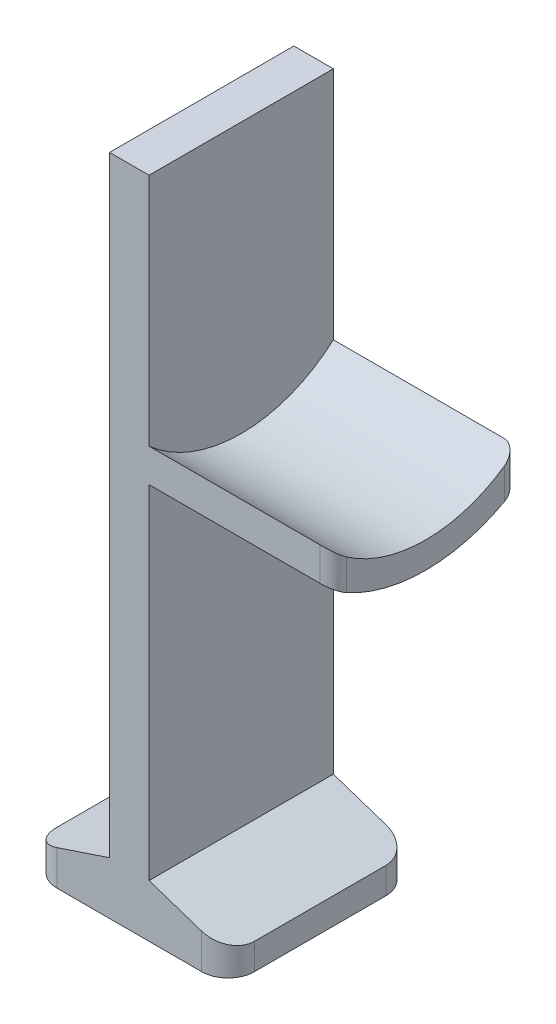
ISO-10303-21;
HEADER;
FILE_DESCRIPTION(('STEP AP214'),'2;1');
FILE_NAME('part.step','',(''),(''),'','','');
FILE_SCHEMA(('AUTOMOTIVE_DESIGN { 1 0 10303 214 1 1 1 1 }'));
ENDSEC;
DATA;
#1=APPLICATION_CONTEXT('core data for automotive mechanical design processes');
#2=APPLICATION_PROTOCOL_DEFINITION('international standard','automotive_design',2000,#1);
#3=PRODUCT_CONTEXT('',#1,'mechanical');
#4=PRODUCT('Part','Part','',(#3));
#5=PRODUCT_RELATED_PRODUCT_CATEGORY('part','',(#4));
#6=PRODUCT_DEFINITION_FORMATION('','',#4);
#7=PRODUCT_DEFINITION_CONTEXT('part definition',#1,'design');
#8=PRODUCT_DEFINITION('design','',#6,#7);
#9=PRODUCT_DEFINITION_SHAPE('','',#8);
#10=(LENGTH_UNIT() NAMED_UNIT(*) SI_UNIT(.MILLI.,.METRE.));
#11=(NAMED_UNIT(*) PLANE_ANGLE_UNIT() SI_UNIT($,.RADIAN.));
#12=(NAMED_UNIT(*) SI_UNIT($,.STERADIAN.) SOLID_ANGLE_UNIT());
#13=UNCERTAINTY_MEASURE_WITH_UNIT(LENGTH_MEASURE(1.E-05),#10,'distance_accuracy_value','');
#14=(GEOMETRIC_REPRESENTATION_CONTEXT(3) GLOBAL_UNCERTAINTY_ASSIGNED_CONTEXT((#13)) GLOBAL_UNIT_ASSIGNED_CONTEXT((#10,
#11,#12)) REPRESENTATION_CONTEXT('',''));
#15=CARTESIAN_POINT('',(0.,0.,0.));
#16=DIRECTION('',(0.,0.,1.));
#17=DIRECTION('',(1.,0.,0.));
#18=AXIS2_PLACEMENT_3D('',#15,#16,#17);
#19=CARTESIAN_POINT('',(1.5,0.,7.));
#20=DIRECTION('',(-1.,0.,0.));
#21=DIRECTION('',(0.,0.,1.));
#22=AXIS2_PLACEMENT_3D('',#19,#20,#21);
#23=PLANE('',#22);
#24=CARTESIAN_POINT('',(1.5,40.4,0.));
#25=DIRECTION('',(-1.,0.,0.));
#26=DIRECTION('',(0.,0.,-1.));
#27=AXIS2_PLACEMENT_3D('',#24,#25,#26);
#28=CIRCLE('',#27,10.5);
#29=CARTESIAN_POINT('',(1.5,32.5737620787507,-7.));
#30=VERTEX_POINT('',#29);
#31=CARTESIAN_POINT('',(1.5,32.5737620787507,7.));
#32=VERTEX_POINT('',#31);
#33=EDGE_CURVE('E166',#30,#32,#28,.T.);
#34=ORIENTED_EDGE('',*,*,#33,.F.);
#35=DIRECTION('',(0.,1.,0.));
#36=VECTOR('',#35,1.);
#37=CARTESIAN_POINT('',(1.5,0.,-7.));
#38=LINE('',#37,#36);
#39=CARTESIAN_POINT('',(1.5,50.4,-7.));
#40=VERTEX_POINT('',#39);
#41=EDGE_CURVE('E172',#30,#40,#38,.T.);
#42=ORIENTED_EDGE('',*,*,#41,.T.);
#43=DIRECTION('',(0.,0.,-1.));
#44=VECTOR('',#43,1.);
#45=CARTESIAN_POINT('',(1.5,50.4,7.));
#46=LINE('',#45,#44);
#47=CARTESIAN_POINT('',(1.5,50.4,7.));
#48=VERTEX_POINT('',#47);
#49=EDGE_CURVE('E235',#48,#40,#46,.T.);
#50=ORIENTED_EDGE('',*,*,#49,.F.);
#51=DIRECTION('',(0.,1.,0.));
#52=VECTOR('',#51,1.);
#53=CARTESIAN_POINT('',(1.5,0.,7.));
#54=LINE('',#53,#52);
#55=EDGE_CURVE('E184',#32,#48,#54,.T.);
#56=ORIENTED_EDGE('',*,*,#55,.F.);
#57=EDGE_LOOP('',(#34,#42,#50,#56));
#58=FACE_BOUND('',#57,.T.);
#59=ADVANCED_FACE('F35',(#58),#23,.F.);
#60=CARTESIAN_POINT('',(1.5,40.4,0.));
#61=DIRECTION('',(1.,0.,0.));
#62=DIRECTION('',(0.,0.,-1.));
#63=AXIS2_PLACEMENT_3D('',#60,#61,#62);
#64=CIRCLE('',#63,12.5);
#65=CARTESIAN_POINT('',(1.5,30.043842411396,7.));
#66=VERTEX_POINT('',#65);
#67=CARTESIAN_POINT('',(1.5,30.043842411396,-7.));
#68=VERTEX_POINT('',#67);
#69=EDGE_CURVE('E185',#66,#68,#64,.T.);
#70=ORIENTED_EDGE('',*,*,#69,.F.);
#71=CARTESIAN_POINT('',(1.5,4.,7.));
#72=VERTEX_POINT('',#71);
#73=EDGE_CURVE('E205',#72,#66,#54,.T.);
#74=ORIENTED_EDGE('',*,*,#73,.F.);
#75=DIRECTION('',(0.,0.,-1.));
#76=VECTOR('',#75,1.);
#77=CARTESIAN_POINT('',(1.5,4.,7.));
#78=LINE('',#77,#76);
#79=CARTESIAN_POINT('',(1.5,4.,-7.));
#80=VERTEX_POINT('',#79);
#81=EDGE_CURVE('E237',#72,#80,#78,.T.);
#82=ORIENTED_EDGE('',*,*,#81,.T.);
#83=EDGE_CURVE('E180',#80,#68,#38,.T.);
#84=ORIENTED_EDGE('',*,*,#83,.T.);
#85=EDGE_LOOP('',(#70,#74,#82,#84));
#86=FACE_BOUND('',#85,.T.);
#87=ADVANCED_FACE('F335',(#86),#23,.F.);
#88=CARTESIAN_POINT('',(0.,0.,7.));
#89=DIRECTION('',(0.,1.,0.));
#90=DIRECTION('',(0.,0.,1.));
#91=AXIS2_PLACEMENT_3D('',#88,#89,#90);
#92=PLANE('',#91);
#93=DIRECTION('',(0.,0.,-1.));
#94=VECTOR('',#93,1.);
#95=CARTESIAN_POINT('',(-7.5,0.,7.));
#96=LINE('',#95,#94);
#97=CARTESIAN_POINT('',(-7.5,0.,5.));
#98=VERTEX_POINT('',#97);
#99=CARTESIAN_POINT('',(-7.5,0.,-5.));
#100=VERTEX_POINT('',#99);
#101=EDGE_CURVE('E216',#98,#100,#96,.T.);
#102=ORIENTED_EDGE('',*,*,#101,.T.);
#103=CARTESIAN_POINT('',(-5.5,0.,-5.));
#104=DIRECTION('',(0.,1.,0.));
#105=DIRECTION('',(0.,0.,1.));
#106=AXIS2_PLACEMENT_3D('',#103,#104,#105);
#107=CIRCLE('',#106,2.);
#108=CARTESIAN_POINT('',(-5.5,0.,-7.));
#109=VERTEX_POINT('',#108);
#110=EDGE_CURVE('E266',#100,#109,#107,.F.);
#111=ORIENTED_EDGE('',*,*,#110,.T.);
#112=DIRECTION('',(1.,0.,0.));
#113=VECTOR('',#112,1.);
#114=CARTESIAN_POINT('',(0.,0.,-7.));
#115=LINE('',#114,#113);
#116=CARTESIAN_POINT('',(5.5,0.,-7.));
#117=VERTEX_POINT('',#116);
#118=EDGE_CURVE('E198',#109,#117,#115,.T.);
#119=ORIENTED_EDGE('',*,*,#118,.T.);
#120=CARTESIAN_POINT('',(5.5,0.,-5.));
#121=DIRECTION('',(0.,1.,0.));
#122=DIRECTION('',(0.,0.,1.));
#123=AXIS2_PLACEMENT_3D('',#120,#121,#122);
#124=CIRCLE('',#123,2.);
#125=CARTESIAN_POINT('',(7.5,0.,-5.));
#126=VERTEX_POINT('',#125);
#127=EDGE_CURVE('E264',#117,#126,#124,.F.);
#128=ORIENTED_EDGE('',*,*,#127,.T.);
#129=DIRECTION('',(0.,0.,-1.));
#130=VECTOR('',#129,1.);
#131=CARTESIAN_POINT('',(7.5,0.,7.));
#132=LINE('',#131,#130);
#133=CARTESIAN_POINT('',(7.5,0.,5.));
#134=VERTEX_POINT('',#133);
#135=EDGE_CURVE('E243',#134,#126,#132,.T.);
#136=ORIENTED_EDGE('',*,*,#135,.F.);
#137=CARTESIAN_POINT('',(5.5,0.,5.));
#138=DIRECTION('',(0.,1.,0.));
#139=DIRECTION('',(0.,0.,1.));
#140=AXIS2_PLACEMENT_3D('',#137,#138,#139);
#141=CIRCLE('',#140,2.);
#142=CARTESIAN_POINT('',(5.5,0.,7.));
#143=VERTEX_POINT('',#142);
#144=EDGE_CURVE('E262',#134,#143,#141,.F.);
#145=ORIENTED_EDGE('',*,*,#144,.T.);
#146=DIRECTION('',(1.,0.,0.));
#147=VECTOR('',#146,1.);
#148=CARTESIAN_POINT('',(0.,0.,7.));
#149=LINE('',#148,#147);
#150=CARTESIAN_POINT('',(-5.5,0.,7.));
#151=VERTEX_POINT('',#150);
#152=EDGE_CURVE('E199',#151,#143,#149,.T.);
#153=ORIENTED_EDGE('',*,*,#152,.F.);
#154=CARTESIAN_POINT('',(-5.5,0.,5.));
#155=DIRECTION('',(0.,1.,0.));
#156=DIRECTION('',(0.,0.,1.));
#157=AXIS2_PLACEMENT_3D('',#154,#155,#156);
#158=CIRCLE('',#157,2.);
#159=EDGE_CURVE('E260',#151,#98,#158,.F.);
#160=ORIENTED_EDGE('',*,*,#159,.T.);
#161=EDGE_LOOP('',(#102,#111,#119,#128,#136,#145,#153,#160));
#162=FACE_BOUND('',#161,.T.);
#163=ADVANCED_FACE('F342',(#162),#92,.F.);
#164=CARTESIAN_POINT('',(7.5,0.,7.));
#165=DIRECTION('',(-1.,0.,0.));
#166=DIRECTION('',(0.,0.,1.));
#167=AXIS2_PLACEMENT_3D('',#164,#165,#166);
#168=PLANE('',#167);
#169=ORIENTED_EDGE('',*,*,#135,.T.);
#170=DIRECTION('',(0.,1.,0.));
#171=VECTOR('',#170,1.);
#172=CARTESIAN_POINT('',(7.5,0.,-5.));
#173=LINE('',#172,#171);
#174=CARTESIAN_POINT('',(7.5,2.,-5.));
#175=VERTEX_POINT('',#174);
#176=EDGE_CURVE('E270',#126,#175,#173,.T.);
#177=ORIENTED_EDGE('',*,*,#176,.T.);
#178=DIRECTION('',(0.,0.,-1.));
#179=VECTOR('',#178,1.);
#180=CARTESIAN_POINT('',(7.5,2.,7.));
#181=LINE('',#180,#179);
#182=CARTESIAN_POINT('',(7.5,2.,5.));
#183=VERTEX_POINT('',#182);
#184=EDGE_CURVE('E240',#183,#175,#181,.T.);
#185=ORIENTED_EDGE('',*,*,#184,.F.);
#186=DIRECTION('',(0.,1.,0.));
#187=VECTOR('',#186,1.);
#188=CARTESIAN_POINT('',(7.5,0.,5.));
#189=LINE('',#188,#187);
#190=EDGE_CURVE('E268',#183,#134,#189,.F.);
#191=ORIENTED_EDGE('',*,*,#190,.T.);
#192=EDGE_LOOP('',(#169,#177,#185,#191));
#193=FACE_BOUND('',#192,.T.);
#194=ADVANCED_FACE('F338',(#193),#168,.F.);
#195=CARTESIAN_POINT('',(1.35,4.05,7.));
#196=DIRECTION('',(-0.316227766016838,-0.948683298050514,0.));
#197=DIRECTION('',(0.948683298050514,-0.316227766016838,0.));
#198=AXIS2_PLACEMENT_3D('',#195,#196,#197);
#199=PLANE('',#198);
#200=ORIENTED_EDGE('',*,*,#184,.T.);
#201=CARTESIAN_POINT('',(5.5,2.66666666666667,-5.));
#202=DIRECTION('',(-0.316227766016838,-0.948683298050514,0.));
#203=DIRECTION('',(-0.948683298050514,0.316227766016838,0.));
#204=AXIS2_PLACEMENT_3D('',#201,#202,#203);
#205=ELLIPSE('',#204,2.10818510677892,2.);
#206=CARTESIAN_POINT('',(5.5,2.66666666666667,-7.));
#207=VERTEX_POINT('',#206);
#208=EDGE_CURVE('E275',#175,#207,#205,.F.);
#209=ORIENTED_EDGE('',*,*,#208,.T.);
#210=DIRECTION('',(-0.948683298050514,0.316227766016838,0.));
#211=VECTOR('',#210,1.);
#212=CARTESIAN_POINT('',(1.35,4.05,-7.));
#213=LINE('',#212,#211);
#214=EDGE_CURVE('E181',#207,#80,#213,.T.);
#215=ORIENTED_EDGE('',*,*,#214,.T.);
#216=ORIENTED_EDGE('',*,*,#81,.F.);
#217=DIRECTION('',(-0.948683298050514,0.316227766016838,0.));
#218=VECTOR('',#217,1.);
#219=CARTESIAN_POINT('',(1.35,4.05,7.));
#220=LINE('',#219,#218);
#221=CARTESIAN_POINT('',(5.5,2.66666666666667,7.));
#222=VERTEX_POINT('',#221);
#223=EDGE_CURVE('E202',#222,#72,#220,.T.);
#224=ORIENTED_EDGE('',*,*,#223,.F.);
#225=CARTESIAN_POINT('',(5.5,2.66666666666667,5.));
#226=DIRECTION('',(-0.316227766016838,-0.948683298050514,0.));
#227=DIRECTION('',(0.948683298050514,-0.316227766016838,0.));
#228=AXIS2_PLACEMENT_3D('',#225,#226,#227);
#229=ELLIPSE('',#228,2.10818510677892,2.);
#230=EDGE_CURVE('E273',#222,#183,#229,.F.);
#231=ORIENTED_EDGE('',*,*,#230,.T.);
#232=EDGE_LOOP('',(#200,#209,#215,#216,#224,#231));
#233=FACE_BOUND('',#232,.T.);
#234=ADVANCED_FACE('F331',(#233),#199,.F.);
#235=CARTESIAN_POINT('',(0.,50.4,7.));
#236=DIRECTION('',(0.,1.,0.));
#237=DIRECTION('',(0.,0.,1.));
#238=AXIS2_PLACEMENT_3D('',#235,#236,#237);
#239=PLANE('',#238);
#240=DIRECTION('',(1.,0.,0.));
#241=VECTOR('',#240,1.);
#242=CARTESIAN_POINT('',(0.,50.4,-7.));
#243=LINE('',#242,#241);
#244=CARTESIAN_POINT('',(-1.5,50.4,-7.));
#245=VERTEX_POINT('',#244);
#246=EDGE_CURVE('E176',#245,#40,#243,.T.);
#247=ORIENTED_EDGE('',*,*,#246,.F.);
#248=DIRECTION('',(0.,0.,-1.));
#249=VECTOR('',#248,1.);
#250=CARTESIAN_POINT('',(-1.5,50.4,7.));
#251=LINE('',#250,#249);
#252=CARTESIAN_POINT('',(-1.5,50.4,7.));
#253=VERTEX_POINT('',#252);
#254=EDGE_CURVE('E233',#253,#245,#251,.T.);
#255=ORIENTED_EDGE('',*,*,#254,.F.);
#256=DIRECTION('',(1.,0.,0.));
#257=VECTOR('',#256,1.);
#258=CARTESIAN_POINT('',(0.,50.4,7.));
#259=LINE('',#258,#257);
#260=EDGE_CURVE('E208',#253,#48,#259,.T.);
#261=ORIENTED_EDGE('',*,*,#260,.T.);
#262=ORIENTED_EDGE('',*,*,#49,.T.);
#263=EDGE_LOOP('',(#247,#255,#261,#262));
#264=FACE_BOUND('',#263,.T.);
#265=ADVANCED_FACE('F327',(#264),#239,.T.);
#266=CARTESIAN_POINT('',(-1.5,0.,7.));
#267=DIRECTION('',(-1.,0.,0.));
#268=DIRECTION('',(0.,0.,1.));
#269=AXIS2_PLACEMENT_3D('',#266,#267,#268);
#270=PLANE('',#269);
#271=DIRECTION('',(0.,1.,0.));
#272=VECTOR('',#271,1.);
#273=CARTESIAN_POINT('',(-1.5,0.,-7.));
#274=LINE('',#273,#272);
#275=CARTESIAN_POINT('',(-1.5,3.99999999999999,-7.));
#276=VERTEX_POINT('',#275);
#277=EDGE_CURVE('E222',#276,#245,#274,.T.);
#278=ORIENTED_EDGE('',*,*,#277,.F.);
#279=DIRECTION('',(0.,0.,-1.));
#280=VECTOR('',#279,1.);
#281=CARTESIAN_POINT('',(-1.5,3.99999999999999,7.));
#282=LINE('',#281,#280);
#283=CARTESIAN_POINT('',(-1.5,3.99999999999999,7.));
#284=VERTEX_POINT('',#283);
#285=EDGE_CURVE('E230',#284,#276,#282,.T.);
#286=ORIENTED_EDGE('',*,*,#285,.F.);
#287=DIRECTION('',(0.,1.,0.));
#288=VECTOR('',#287,1.);
#289=CARTESIAN_POINT('',(-1.5,0.,7.));
#290=LINE('',#289,#288);
#291=EDGE_CURVE('E211',#284,#253,#290,.T.);
#292=ORIENTED_EDGE('',*,*,#291,.T.);
#293=ORIENTED_EDGE('',*,*,#254,.T.);
#294=EDGE_LOOP('',(#278,#286,#292,#293));
#295=FACE_BOUND('',#294,.T.);
#296=ADVANCED_FACE('F323',(#295),#270,.T.);
#297=CARTESIAN_POINT('',(-1.34999999999999,4.05,7.));
#298=DIRECTION('',(-0.316227766016837,0.948683298050514,0.));
#299=DIRECTION('',(-0.948683298050514,-0.316227766016837,0.));
#300=AXIS2_PLACEMENT_3D('',#297,#298,#299);
#301=PLANE('',#300);
#302=DIRECTION('',(0.948683298050514,0.316227766016837,0.));
#303=VECTOR('',#302,1.);
#304=CARTESIAN_POINT('',(-1.34999999999999,4.05,-7.));
#305=LINE('',#304,#303);
#306=CARTESIAN_POINT('',(-5.5,2.66666666666667,-7.));
#307=VERTEX_POINT('',#306);
#308=EDGE_CURVE('E203',#307,#276,#305,.T.);
#309=ORIENTED_EDGE('',*,*,#308,.F.);
#310=CARTESIAN_POINT('',(-5.5,2.66666666666667,-5.));
#311=DIRECTION('',(-0.316227766016837,0.948683298050514,0.));
#312=DIRECTION('',(-0.948683298050514,-0.316227766016837,0.));
#313=AXIS2_PLACEMENT_3D('',#310,#311,#312);
#314=ELLIPSE('',#313,2.10818510677892,2.);
#315=CARTESIAN_POINT('',(-7.5,2.,-5.));
#316=VERTEX_POINT('',#315);
#317=EDGE_CURVE('E253',#307,#316,#314,.T.);
#318=ORIENTED_EDGE('',*,*,#317,.T.);
#319=DIRECTION('',(0.,0.,-1.));
#320=VECTOR('',#319,1.);
#321=CARTESIAN_POINT('',(-7.5,2.,7.));
#322=LINE('',#321,#320);
#323=CARTESIAN_POINT('',(-7.5,2.,5.));
#324=VERTEX_POINT('',#323);
#325=EDGE_CURVE('E227',#324,#316,#322,.T.);
#326=ORIENTED_EDGE('',*,*,#325,.F.);
#327=CARTESIAN_POINT('',(-5.5,2.66666666666667,5.));
#328=DIRECTION('',(-0.316227766016837,0.948683298050514,0.));
#329=DIRECTION('',(0.948683298050514,0.316227766016837,0.));
#330=AXIS2_PLACEMENT_3D('',#327,#328,#329);
#331=ELLIPSE('',#330,2.10818510677892,2.);
#332=CARTESIAN_POINT('',(-5.5,2.66666666666667,7.));
#333=VERTEX_POINT('',#332);
#334=EDGE_CURVE('E251',#324,#333,#331,.T.);
#335=ORIENTED_EDGE('',*,*,#334,.T.);
#336=DIRECTION('',(0.948683298050514,0.316227766016837,0.));
#337=VECTOR('',#336,1.);
#338=CARTESIAN_POINT('',(-1.34999999999999,4.05,7.));
#339=LINE('',#338,#337);
#340=EDGE_CURVE('E214',#333,#284,#339,.T.);
#341=ORIENTED_EDGE('',*,*,#340,.T.);
#342=ORIENTED_EDGE('',*,*,#285,.T.);
#343=EDGE_LOOP('',(#309,#318,#326,#335,#341,#342));
#344=FACE_BOUND('',#343,.T.);
#345=ADVANCED_FACE('F319',(#344),#301,.T.);
#346=CARTESIAN_POINT('',(-7.5,0.,7.));
#347=DIRECTION('',(-1.,0.,0.));
#348=DIRECTION('',(0.,0.,1.));
#349=AXIS2_PLACEMENT_3D('',#346,#347,#348);
#350=PLANE('',#349);
#351=ORIENTED_EDGE('',*,*,#325,.T.);
#352=DIRECTION('',(0.,1.,0.));
#353=VECTOR('',#352,1.);
#354=CARTESIAN_POINT('',(-7.5,0.,-5.));
#355=LINE('',#354,#353);
#356=EDGE_CURVE('E258',#316,#100,#355,.F.);
#357=ORIENTED_EDGE('',*,*,#356,.T.);
#358=ORIENTED_EDGE('',*,*,#101,.F.);
#359=DIRECTION('',(0.,1.,0.));
#360=VECTOR('',#359,1.);
#361=CARTESIAN_POINT('',(-7.5,0.,5.));
#362=LINE('',#361,#360);
#363=EDGE_CURVE('E255',#98,#324,#362,.T.);
#364=ORIENTED_EDGE('',*,*,#363,.T.);
#365=EDGE_LOOP('',(#351,#357,#358,#364));
#366=FACE_BOUND('',#365,.T.);
#367=ADVANCED_FACE('F312',(#366),#350,.T.);
#368=CARTESIAN_POINT('',(0.,0.,7.));
#369=DIRECTION('',(0.,0.,1.));
#370=DIRECTION('',(1.,0.,0.));
#371=AXIS2_PLACEMENT_3D('',#368,#369,#370);
#372=PLANE('',#371);
#373=DIRECTION('',(-1.,0.,0.));
#374=VECTOR('',#373,1.);
#375=CARTESIAN_POINT('',(15.5,30.043842411396,7.));
#376=LINE('',#375,#374);
#377=CARTESIAN_POINT('',(14.5,30.043842411396,7.));
#378=VERTEX_POINT('',#377);
#379=EDGE_CURVE('E194',#378,#66,#376,.T.);
#380=ORIENTED_EDGE('',*,*,#379,.F.);
#381=DIRECTION('',(0.,-1.,0.));
#382=VECTOR('',#381,1.);
#383=CARTESIAN_POINT('',(14.5,0.,7.));
#384=LINE('',#383,#382);
#385=CARTESIAN_POINT('',(14.5,32.5737620787507,7.));
#386=VERTEX_POINT('',#385);
#387=EDGE_CURVE('E11',#378,#386,#384,.F.);
#388=ORIENTED_EDGE('',*,*,#387,.T.);
#389=DIRECTION('',(-1.,0.,0.));
#390=VECTOR('',#389,1.);
#391=CARTESIAN_POINT('',(15.5,32.5737620787507,7.));
#392=LINE('',#391,#390);
#393=EDGE_CURVE('E196',#386,#32,#392,.T.);
#394=ORIENTED_EDGE('',*,*,#393,.T.);
#395=ORIENTED_EDGE('',*,*,#55,.T.);
#396=ORIENTED_EDGE('',*,*,#260,.F.);
#397=ORIENTED_EDGE('',*,*,#291,.F.);
#398=ORIENTED_EDGE('',*,*,#340,.F.);
#399=DIRECTION('',(0.,1.,0.));
#400=VECTOR('',#399,1.);
#401=CARTESIAN_POINT('',(-5.5,0.,7.));
#402=LINE('',#401,#400);
#403=EDGE_CURVE('E277',#333,#151,#402,.F.);
#404=ORIENTED_EDGE('',*,*,#403,.T.);
#405=ORIENTED_EDGE('',*,*,#152,.T.);
#406=DIRECTION('',(0.,1.,0.));
#407=VECTOR('',#406,1.);
#408=CARTESIAN_POINT('',(5.5,2.,7.));
#409=LINE('',#408,#407);
#410=EDGE_CURVE('E279',#143,#222,#409,.T.);
#411=ORIENTED_EDGE('',*,*,#410,.T.);
#412=ORIENTED_EDGE('',*,*,#223,.T.);
#413=ORIENTED_EDGE('',*,*,#73,.T.);
#414=EDGE_LOOP('',(#380,#388,#394,#395,#396,#397,#398,#404,#405,#411,#412,#413));
#415=FACE_BOUND('',#414,.T.);
#416=ADVANCED_FACE('F308',(#415),#372,.T.);
#417=CARTESIAN_POINT('',(0.,0.,-7.));
#418=DIRECTION('',(0.,0.,1.));
#419=DIRECTION('',(1.,0.,0.));
#420=AXIS2_PLACEMENT_3D('',#417,#418,#419);
#421=PLANE('',#420);
#422=DIRECTION('',(-1.,0.,0.));
#423=VECTOR('',#422,1.);
#424=CARTESIAN_POINT('',(15.5,32.5737620787507,-7.));
#425=LINE('',#424,#423);
#426=CARTESIAN_POINT('',(14.5,32.5737620787507,-7.));
#427=VERTEX_POINT('',#426);
#428=EDGE_CURVE('E160',#427,#30,#425,.T.);
#429=ORIENTED_EDGE('',*,*,#428,.F.);
#430=DIRECTION('',(0.,1.,0.));
#431=VECTOR('',#430,1.);
#432=CARTESIAN_POINT('',(14.5,30.043842411396,-7.));
#433=LINE('',#432,#431);
#434=CARTESIAN_POINT('',(14.5,30.043842411396,-7.));
#435=VERTEX_POINT('',#434);
#436=EDGE_CURVE('E59',#427,#435,#433,.F.);
#437=ORIENTED_EDGE('',*,*,#436,.T.);
#438=DIRECTION('',(-1.,0.,0.));
#439=VECTOR('',#438,1.);
#440=CARTESIAN_POINT('',(15.5,30.043842411396,-7.));
#441=LINE('',#440,#439);
#442=EDGE_CURVE('E168',#435,#68,#441,.T.);
#443=ORIENTED_EDGE('',*,*,#442,.T.);
#444=ORIENTED_EDGE('',*,*,#83,.F.);
#445=ORIENTED_EDGE('',*,*,#214,.F.);
#446=DIRECTION('',(0.,1.,0.));
#447=VECTOR('',#446,1.);
#448=CARTESIAN_POINT('',(5.5,0.,-7.));
#449=LINE('',#448,#447);
#450=EDGE_CURVE('E246',#207,#117,#449,.F.);
#451=ORIENTED_EDGE('',*,*,#450,.T.);
#452=ORIENTED_EDGE('',*,*,#118,.F.);
#453=DIRECTION('',(0.,1.,0.));
#454=VECTOR('',#453,1.);
#455=CARTESIAN_POINT('',(-5.5,2.,-7.));
#456=LINE('',#455,#454);
#457=EDGE_CURVE('E248',#109,#307,#456,.T.);
#458=ORIENTED_EDGE('',*,*,#457,.T.);
#459=ORIENTED_EDGE('',*,*,#308,.T.);
#460=ORIENTED_EDGE('',*,*,#277,.T.);
#461=ORIENTED_EDGE('',*,*,#246,.T.);
#462=ORIENTED_EDGE('',*,*,#41,.F.);
#463=EDGE_LOOP('',(#429,#437,#443,#444,#445,#451,#452,#458,#459,#460,#461,#462));
#464=FACE_BOUND('',#463,.T.);
#465=ADVANCED_FACE('F173',(#464),#421,.F.);
#466=CARTESIAN_POINT('',(-5.5,0.,-5.));
#467=DIRECTION('',(0.,-1.,0.));
#468=DIRECTION('',(0.,0.,-1.));
#469=AXIS2_PLACEMENT_3D('',#466,#467,#468);
#470=CYLINDRICAL_SURFACE('',#469,2.);
#471=ORIENTED_EDGE('',*,*,#110,.F.);
#472=ORIENTED_EDGE('',*,*,#356,.F.);
#473=ORIENTED_EDGE('',*,*,#317,.F.);
#474=ORIENTED_EDGE('',*,*,#457,.F.);
#475=EDGE_LOOP('',(#471,#472,#473,#474));
#476=FACE_BOUND('',#475,.T.);
#477=ADVANCED_FACE('F316',(#476),#470,.T.);
#478=CARTESIAN_POINT('',(5.5,0.,-5.));
#479=DIRECTION('',(0.,1.,0.));
#480=DIRECTION('',(0.,0.,1.));
#481=AXIS2_PLACEMENT_3D('',#478,#479,#480);
#482=CYLINDRICAL_SURFACE('',#481,2.);
#483=ORIENTED_EDGE('',*,*,#127,.F.);
#484=ORIENTED_EDGE('',*,*,#450,.F.);
#485=ORIENTED_EDGE('',*,*,#208,.F.);
#486=ORIENTED_EDGE('',*,*,#176,.F.);
#487=EDGE_LOOP('',(#483,#484,#485,#486));
#488=FACE_BOUND('',#487,.T.);
#489=ADVANCED_FACE('F349',(#488),#482,.T.);
#490=CARTESIAN_POINT('',(5.5,0.,5.));
#491=DIRECTION('',(0.,-1.,0.));
#492=DIRECTION('',(0.,0.,-1.));
#493=AXIS2_PLACEMENT_3D('',#490,#491,#492);
#494=CYLINDRICAL_SURFACE('',#493,2.);
#495=ORIENTED_EDGE('',*,*,#144,.F.);
#496=ORIENTED_EDGE('',*,*,#190,.F.);
#497=ORIENTED_EDGE('',*,*,#230,.F.);
#498=ORIENTED_EDGE('',*,*,#410,.F.);
#499=EDGE_LOOP('',(#495,#496,#497,#498));
#500=FACE_BOUND('',#499,.T.);
#501=ADVANCED_FACE('F353',(#500),#494,.T.);
#502=CARTESIAN_POINT('',(-5.5,0.,5.));
#503=DIRECTION('',(0.,1.,0.));
#504=DIRECTION('',(0.,0.,1.));
#505=AXIS2_PLACEMENT_3D('',#502,#503,#504);
#506=CYLINDRICAL_SURFACE('',#505,2.);
#507=ORIENTED_EDGE('',*,*,#159,.F.);
#508=ORIENTED_EDGE('',*,*,#403,.F.);
#509=ORIENTED_EDGE('',*,*,#334,.F.);
#510=ORIENTED_EDGE('',*,*,#363,.F.);
#511=EDGE_LOOP('',(#507,#508,#509,#510));
#512=FACE_BOUND('',#511,.T.);
#513=ADVANCED_FACE('F305',(#512),#506,.T.);
#514=CARTESIAN_POINT('',(15.5,40.4,0.));
#515=DIRECTION('',(-1.,0.,0.));
#516=DIRECTION('',(0.,0.,1.));
#517=AXIS2_PLACEMENT_3D('',#514,#515,#516);
#518=CYLINDRICAL_SURFACE('',#517,10.5);
#519=CARTESIAN_POINT('',(15.5,40.4,0.));
#520=DIRECTION('',(-1.,0.,0.));
#521=DIRECTION('',(0.,0.,-1.));
#522=AXIS2_PLACEMENT_3D('',#519,#520,#521);
#523=CIRCLE('',#522,10.5);
#524=CARTESIAN_POINT('',(15.5,31.783156030193,-6.));
#525=VERTEX_POINT('',#524);
#526=CARTESIAN_POINT('',(15.5,31.783156030193,6.));
#527=VERTEX_POINT('',#526);
#528=EDGE_CURVE('E188',#525,#527,#523,.T.);
#529=ORIENTED_EDGE('',*,*,#528,.F.);
#530=CARTESIAN_POINT('',(15.5,31.783156030193,-6.));
#531=CARTESIAN_POINT('',(15.4999942383132,31.807349611963,-6.03474765706241));
#532=CARTESIAN_POINT('',(15.4981887058408,31.8317406580638,-6.06932557460702));
#533=CARTESIAN_POINT('',(15.491042100921,31.880762088754,-6.13794429307205));
#534=CARTESIAN_POINT('',(15.485700938458,31.9053924794211,-6.17198508029475));
#535=CARTESIAN_POINT('',(15.4643797277901,31.9797226456763,-6.27343287911811));
#536=CARTESIAN_POINT('',(15.4431033833854,32.0295482869697,-6.33971619238151));
#537=CARTESIAN_POINT('',(15.3869885563811,32.1274815154341,-6.46698295270807));
#538=CARTESIAN_POINT('',(15.3522228406062,32.1755968336806,-6.52799272377356));
#539=CARTESIAN_POINT('',(15.2691324587349,32.2682073893226,-6.64299281065758));
#540=CARTESIAN_POINT('',(15.22085277564,32.3127140154394,-6.69700555902673));
#541=CARTESIAN_POINT('',(15.1293835567848,32.3811436663708,-6.77862538050529));
#542=CARTESIAN_POINT('',(15.0900178570646,32.4069294228777,-6.80897639170275));
#543=CARTESIAN_POINT('',(15.0054558152114,32.4544122327095,-6.86432497262886));
#544=CARTESIAN_POINT('',(14.960267028802,32.4761144963188,-6.88932936994305));
#545=CARTESIAN_POINT('',(14.8729373815328,32.5106833768382,-6.92887099127325));
#546=CARTESIAN_POINT('',(14.8316284422906,32.5244297382015,-6.94447164534601));
#547=CARTESIAN_POINT('',(14.7461510130838,32.547238035942,-6.97025312305452));
#548=CARTESIAN_POINT('',(14.7019884866302,32.5563094073067,-6.9804448641185));
#549=CARTESIAN_POINT('',(14.6312168923526,32.5663429597399,-6.99169844257489));
#550=CARTESIAN_POINT('',(14.6051666762821,32.5691138280707,-6.99480054250098));
#551=CARTESIAN_POINT('',(14.5527505303686,32.5728275820239,-6.99895525019277));
#552=CARTESIAN_POINT('',(14.5263843283668,32.5737687578439,-7.00000594097126));
#553=CARTESIAN_POINT('',(14.5,32.5737620787507,-7.));
#554=B_SPLINE_CURVE_WITH_KNOTS('',3,(#530,#531,#532,#533,#534,#535,#536,#537,#538,#539,#540,
#541,#542,#543,#544,#545,#546,#547,#548,#549,#550,#551,#552,#553),.UNSPECIFIED.,.F.,.F.,(4,2,2,
2,2,2,2,2,2,2,2,4),(0.,0.126932997916851,0.25386922762131,0.509363623461381,0.763498528258096,
1.01679737073948,1.18421831687669,1.35142417376227,1.48961382519519,1.62752348150135,
1.70653156308997,1.78561344035609),.UNSPECIFIED.);
#555=EDGE_CURVE('E167',#525,#427,#554,.T.);
#556=ORIENTED_EDGE('',*,*,#555,.T.);
#557=ORIENTED_EDGE('',*,*,#428,.T.);
#558=ORIENTED_EDGE('',*,*,#33,.T.);
#559=ORIENTED_EDGE('',*,*,#393,.F.);
#560=CARTESIAN_POINT('',(14.5,32.5737620787507,7.));
#561=CARTESIAN_POINT('',(14.5233678375098,32.5737654225892,7.00000287521798));
#562=CARTESIAN_POINT('',(14.5467215515672,32.5730288043011,6.99918024624991));
#563=CARTESIAN_POINT('',(14.5932079597811,32.5701130819261,6.99591868195207));
#564=CARTESIAN_POINT('',(14.6163408069579,32.5679350631597,6.99348096272303));
#565=CARTESIAN_POINT('',(14.6847618154525,32.5593447989247,6.98385299699428));
#566=CARTESIAN_POINT('',(14.7294962681946,32.5508748636047,6.97434652393229));
#567=CARTESIAN_POINT('',(14.8160011657874,32.5291546237729,6.94982408386478));
#568=CARTESIAN_POINT('',(14.8577791187019,32.5159169893833,6.93482271771216));
#569=CARTESIAN_POINT('',(14.937867388101,32.4855111240705,6.90010143638277));
#570=CARTESIAN_POINT('',(14.9761698456481,32.4683342802866,6.8803711774188));
#571=CARTESIAN_POINT('',(15.0625307056928,32.4238681545908,6.82882598514913));
#572=CARTESIAN_POINT('',(15.108835433169,32.3952060012761,6.79525759283506));
#573=CARTESIAN_POINT('',(15.1937149478491,32.33394340599,6.7224256877596));
#574=CARTESIAN_POINT('',(15.2322757875128,32.3013360244968,6.68315211471022));
#575=CARTESIAN_POINT('',(15.3104054239139,32.2250709720889,6.58976564283384));
#576=CARTESIAN_POINT('',(15.3477843542501,32.180697898418,6.53440594851078));
#577=CARTESIAN_POINT('',(15.4104996413331,32.0900345154242,6.41871387152439));
#578=CARTESIAN_POINT('',(15.4358325456809,32.0437436605914,6.35838006908476));
#579=CARTESIAN_POINT('',(15.4699388721369,31.9613791025227,6.24845993562013));
#580=CARTESIAN_POINT('',(15.4811716813628,31.9253838642862,6.19956202339634));
#581=CARTESIAN_POINT('',(15.4961825082306,31.853831475262,6.1005554251459));
#582=CARTESIAN_POINT('',(15.4999831639779,31.818273322991,6.05045088797271));
#583=CARTESIAN_POINT('',(15.5,31.783156030193,6.));
#584=B_SPLINE_CURVE_WITH_KNOTS('',3,(#560,#561,#562,#563,#564,#565,#566,#567,#568,#569,#570,
#571,#572,#573,#574,#575,#576,#577,#578,#579,#580,#581,#582,#583),.UNSPECIFIED.,.F.,.F.,(4,2,2,
2,2,2,2,2,2,2,2,4),(0.,0.0700507121010061,0.140048738567918,0.278792847070183,0.417170932345066,
0.555854507847387,0.746733033968972,0.937952328054901,1.17730804897748,1.41673232812399,
1.60153290199558,1.7857696968999),.UNSPECIFIED.);
#585=EDGE_CURVE('E288',#386,#527,#584,.T.);
#586=ORIENTED_EDGE('',*,*,#585,.T.);
#587=EDGE_LOOP('',(#529,#556,#557,#558,#559,#586));
#588=FACE_BOUND('',#587,.T.);
#589=ADVANCED_FACE('F163',(#588),#518,.F.);
#590=CARTESIAN_POINT('',(15.5,40.4,0.));
#591=DIRECTION('',(-1.,0.,0.));
#592=DIRECTION('',(0.,0.,1.));
#593=AXIS2_PLACEMENT_3D('',#590,#591,#592);
#594=CYLINDRICAL_SURFACE('',#593,12.5);
#595=ORIENTED_EDGE('',*,*,#442,.F.);
#596=CARTESIAN_POINT('',(14.5,30.043842411396,-7.));
#597=CARTESIAN_POINT('',(14.524863380475,30.0438443682277,-7.00000200627018));
#598=CARTESIAN_POINT('',(14.5497130999693,30.043215096129,-6.99907199917212));
#599=CARTESIAN_POINT('',(14.5992014328461,30.040718344597,-6.9953764113714));
#600=CARTESIAN_POINT('',(14.6238401410122,30.0388514542137,-6.9926117039018));
#601=CARTESIAN_POINT('',(14.6968871583155,30.0314614219148,-6.98165373903995));
#602=CARTESIAN_POINT('',(14.7447485557688,30.0241482326678,-6.97079580141623));
#603=CARTESIAN_POINT('',(14.8374840274932,30.0052478626996,-6.94257954223112));
#604=CARTESIAN_POINT('',(14.8823624826995,29.9936671209603,-6.92523101322508));
#605=CARTESIAN_POINT('',(14.9683496143102,29.9668881033695,-6.88482117799568));
#606=CARTESIAN_POINT('',(15.0094534938699,29.9516853102932,-6.86175273673454));
#607=CARTESIAN_POINT('',(15.0899528315852,29.9172056267964,-6.80897063625964));
#608=CARTESIAN_POINT('',(15.1290241241465,29.8977172221874,-6.77890340515245));
#609=CARTESIAN_POINT('',(15.2016308967702,29.8562340850454,-6.71419981192036));
#610=CARTESIAN_POINT('',(15.2351648819949,29.8342386784282,-6.67956222051772));
#611=CARTESIAN_POINT('',(15.3014745117665,29.7846967015179,-6.60059398558716));
#612=CARTESIAN_POINT('',(15.3332278300224,29.7568307689425,-6.55560473411309));
#613=CARTESIAN_POINT('',(15.3886825494776,29.6995918215255,-6.46175687999291));
#614=CARTESIAN_POINT('',(15.4123760171984,29.6702173543392,-6.4128945229501));
#615=CARTESIAN_POINT('',(15.454418886254,29.606322828323,-6.30483882226142));
#616=CARTESIAN_POINT('',(15.4714411421727,29.5716896361428,-6.24519261859696));
#617=CARTESIAN_POINT('',(15.4942256860194,29.5025635205304,-6.12379779229501));
#618=CARTESIAN_POINT('',(15.5000001613886,29.4680704857334,-6.06205151909304));
#619=CARTESIAN_POINT('',(15.5,29.4341439002693,-6.));
#620=B_SPLINE_CURVE_WITH_KNOTS('',3,(#596,#597,#598,#599,#600,#601,#602,#603,#604,#605,#606,
#607,#608,#609,#610,#611,#612,#613,#614,#615,#616,#617,#618,#619),.UNSPECIFIED.,.F.,.F.,(4,2,2,
2,2,2,2,2,2,2,2,4),(0.,0.0745384989974134,0.149041546515323,0.297094804314176,0.444925584521472,
0.592941705308957,0.751381622572695,0.909864242203684,1.09428442478633,1.27888561424557,
1.49106466371625,1.70301368013074),.UNSPECIFIED.);
#621=CARTESIAN_POINT('',(15.5,29.4341439002693,-6.));
#622=VERTEX_POINT('',#621);
#623=EDGE_CURVE('E44',#435,#622,#620,.T.);
#624=ORIENTED_EDGE('',*,*,#623,.T.);
#625=CARTESIAN_POINT('',(15.5,40.4,0.));
#626=DIRECTION('',(1.,0.,0.));
#627=DIRECTION('',(0.,0.,-1.));
#628=AXIS2_PLACEMENT_3D('',#625,#626,#627);
#629=CIRCLE('',#628,12.5);
#630=CARTESIAN_POINT('',(15.5,29.4341439002693,6.));
#631=VERTEX_POINT('',#630);
#632=EDGE_CURVE('E169',#631,#622,#629,.T.);
#633=ORIENTED_EDGE('',*,*,#632,.F.);
#634=CARTESIAN_POINT('',(15.5,29.4341439002693,6.));
#635=CARTESIAN_POINT('',(15.4999932539319,29.4546295453877,6.03744333388135));
#636=CARTESIAN_POINT('',(15.4978958386873,29.4752926791712,6.07474893384738));
#637=CARTESIAN_POINT('',(15.4895705950739,29.5168031440164,6.14880682596662));
#638=CARTESIAN_POINT('',(15.4833416000971,29.537650525462,6.18555895884236));
#639=CARTESIAN_POINT('',(15.4584854741626,29.6003212093137,6.29475608582398));
#640=CARTESIAN_POINT('',(15.4336897919387,29.6421469974387,6.36591181035401));
#641=CARTESIAN_POINT('',(15.3728926723397,29.7179628315399,6.49220709642456));
#642=CARTESIAN_POINT('',(15.3389558941737,29.7522279800842,6.548192126708));
#643=CARTESIAN_POINT('',(15.2598069591389,29.8176873455846,6.65345568149751));
#644=CARTESIAN_POINT('',(15.2146285454261,29.8488903699466,6.70275360601016));
#645=CARTESIAN_POINT('',(15.1257304715265,29.8995346450729,6.78173170528414));
#646=CARTESIAN_POINT('',(15.0842500042597,29.9200034813936,6.8132831593923));
#647=CARTESIAN_POINT('',(14.9956179935095,29.957182135411,6.87013155679718));
#648=CARTESIAN_POINT('',(14.9484659877032,29.9738916463422,6.89542798969319));
#649=CARTESIAN_POINT('',(14.8490741141738,30.0026210568167,6.93867396653816));
#650=CARTESIAN_POINT('',(14.7967970295339,30.0146029048635,6.95656395273154));
#651=CARTESIAN_POINT('',(14.6891041960423,30.0327046530042,6.98351339105621));
#652=CARTESIAN_POINT('',(14.633697839036,30.0388411994654,6.99259792084947));
#653=CARTESIAN_POINT('',(14.5649164771931,30.0424749675763,6.99797645512241));
#654=CARTESIAN_POINT('',(14.5519416072599,30.0429877043894,6.99873530355535));
#655=CARTESIAN_POINT('',(14.5259797886709,30.0436707973293,6.99974618480339));
#656=CARTESIAN_POINT('',(14.5129928768231,30.0438415915346,6.9999988660928));
#657=CARTESIAN_POINT('',(14.5,30.043842411396,7.));
#658=B_SPLINE_CURVE_WITH_KNOTS('',3,(#634,#635,#636,#637,#638,#639,#640,#641,#642,#643,#644,
#645,#646,#647,#648,#649,#650,#651,#652,#653,#654,#655,#656,#657),.UNSPECIFIED.,.F.,.F.,(4,2,2,
2,2,2,2,2,2,2,2,4),(0.,0.127922376305208,0.255880888629821,0.512571706770062,0.73318648170432,
0.953146877932358,1.12045816622019,1.2877831023658,1.45642857886322,1.62459233469733,
1.66360548956803,1.70256863082111),.UNSPECIFIED.);
#659=EDGE_CURVE('E51',#631,#378,#658,.T.);
#660=ORIENTED_EDGE('',*,*,#659,.T.);
#661=ORIENTED_EDGE('',*,*,#379,.T.);
#662=ORIENTED_EDGE('',*,*,#69,.T.);
#663=EDGE_LOOP('',(#595,#624,#633,#660,#661,#662));
#664=FACE_BOUND('',#663,.T.);
#665=ADVANCED_FACE('F304',(#664),#594,.T.);
#666=CARTESIAN_POINT('',(15.5,40.4,0.));
#667=DIRECTION('',(1.,0.,0.));
#668=DIRECTION('',(0.,0.,-1.));
#669=AXIS2_PLACEMENT_3D('',#666,#667,#668);
#670=PLANE('',#669);
#671=ORIENTED_EDGE('',*,*,#632,.T.);
#672=DIRECTION('',(0.,1.,0.));
#673=VECTOR('',#672,1.);
#674=CARTESIAN_POINT('',(15.5,32.5737620787507,-6.));
#675=LINE('',#674,#673);
#676=EDGE_CURVE('E285',#622,#525,#675,.T.);
#677=ORIENTED_EDGE('',*,*,#676,.T.);
#678=ORIENTED_EDGE('',*,*,#528,.T.);
#679=DIRECTION('',(0.,-1.,0.));
#680=VECTOR('',#679,1.);
#681=CARTESIAN_POINT('',(15.5,40.4,6.));
#682=LINE('',#681,#680);
#683=EDGE_CURVE('E282',#527,#631,#682,.T.);
#684=ORIENTED_EDGE('',*,*,#683,.T.);
#685=EDGE_LOOP('',(#671,#677,#678,#684));
#686=FACE_BOUND('',#685,.T.);
#687=ADVANCED_FACE('F363',(#686),#670,.T.);
#688=CARTESIAN_POINT('',(14.5,40.4,-6.));
#689=DIRECTION('',(0.,-1.,0.));
#690=DIRECTION('',(0.,0.,-1.));
#691=AXIS2_PLACEMENT_3D('',#688,#689,#690);
#692=CYLINDRICAL_SURFACE('',#691,1.);
#693=ORIENTED_EDGE('',*,*,#623,.F.);
#694=ORIENTED_EDGE('',*,*,#436,.F.);
#695=ORIENTED_EDGE('',*,*,#555,.F.);
#696=ORIENTED_EDGE('',*,*,#676,.F.);
#697=EDGE_LOOP('',(#693,#694,#695,#696));
#698=FACE_BOUND('',#697,.T.);
#699=ADVANCED_FACE('F360',(#698),#692,.T.);
#700=CARTESIAN_POINT('',(14.5,40.4,6.));
#701=DIRECTION('',(0.,-1.,0.));
#702=DIRECTION('',(0.,0.,-1.));
#703=AXIS2_PLACEMENT_3D('',#700,#701,#702);
#704=CYLINDRICAL_SURFACE('',#703,1.);
#705=ORIENTED_EDGE('',*,*,#585,.F.);
#706=ORIENTED_EDGE('',*,*,#387,.F.);
#707=ORIENTED_EDGE('',*,*,#659,.F.);
#708=ORIENTED_EDGE('',*,*,#683,.F.);
#709=EDGE_LOOP('',(#705,#706,#707,#708));
#710=FACE_BOUND('',#709,.T.);
#711=ADVANCED_FACE('F37',(#710),#704,.T.);
#712=CLOSED_SHELL('',(#59,#87,#163,#194,#234,#265,#296,#345,#367,#416,#465,#477,#489,#501,#513,
#589,#665,#687,#699,#711));
#713=MANIFOLD_SOLID_BREP('B2',#712);
#714=ADVANCED_BREP_SHAPE_REPRESENTATION('',(#18,#713),#14);
#715=SHAPE_DEFINITION_REPRESENTATION(#9,#714);
ENDSEC;
END-ISO-10303-21;
